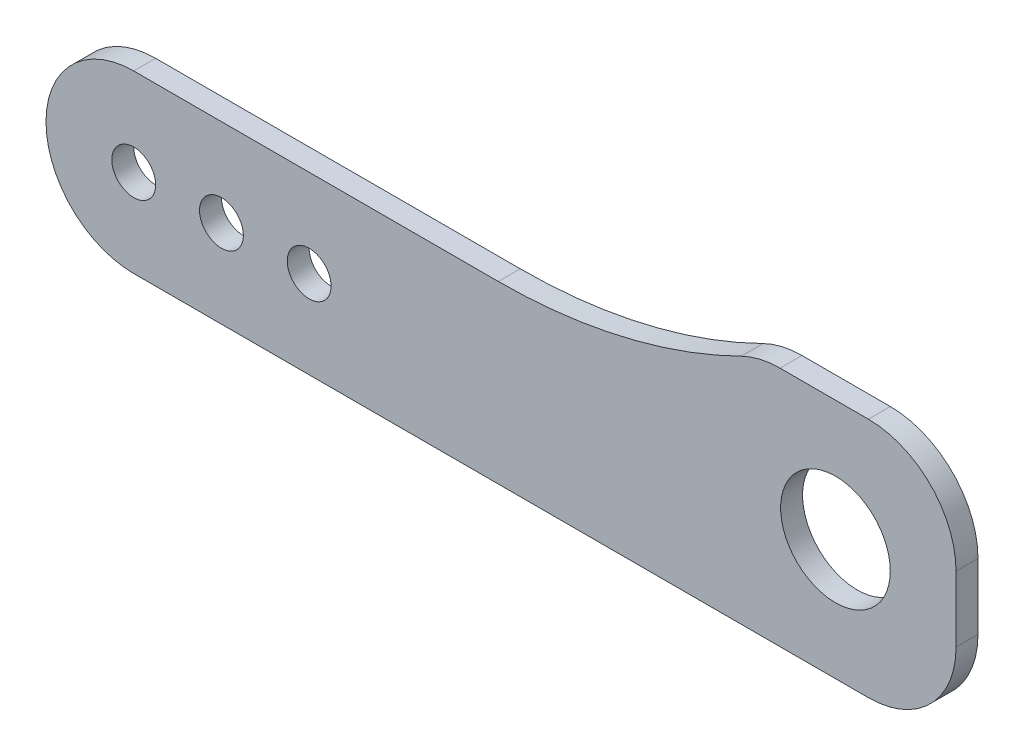
ISO-10303-21;
HEADER;
FILE_DESCRIPTION(('STEP AP214'),'2;1');
FILE_NAME('part.step','',(''),(''),'','','');
FILE_SCHEMA(('AUTOMOTIVE_DESIGN { 1 0 10303 214 1 1 1 1 }'));
ENDSEC;
DATA;
#1=APPLICATION_CONTEXT('core data for automotive mechanical design processes');
#2=APPLICATION_PROTOCOL_DEFINITION('international standard','automotive_design',2000,#1);
#3=PRODUCT_CONTEXT('',#1,'mechanical');
#4=PRODUCT('Part','Part','',(#3));
#5=PRODUCT_RELATED_PRODUCT_CATEGORY('part','',(#4));
#6=PRODUCT_DEFINITION_FORMATION('','',#4);
#7=PRODUCT_DEFINITION_CONTEXT('part definition',#1,'design');
#8=PRODUCT_DEFINITION('design','',#6,#7);
#9=PRODUCT_DEFINITION_SHAPE('','',#8);
#10=(LENGTH_UNIT() NAMED_UNIT(*) SI_UNIT(.MILLI.,.METRE.));
#11=(NAMED_UNIT(*) PLANE_ANGLE_UNIT() SI_UNIT($,.RADIAN.));
#12=(NAMED_UNIT(*) SI_UNIT($,.STERADIAN.) SOLID_ANGLE_UNIT());
#13=UNCERTAINTY_MEASURE_WITH_UNIT(LENGTH_MEASURE(1.E-05),#10,'distance_accuracy_value','');
#14=(GEOMETRIC_REPRESENTATION_CONTEXT(3) GLOBAL_UNCERTAINTY_ASSIGNED_CONTEXT((#13)) GLOBAL_UNIT_ASSIGNED_CONTEXT((#10,
#11,#12)) REPRESENTATION_CONTEXT('',''));
#15=CARTESIAN_POINT('',(0.,0.,0.));
#16=DIRECTION('',(0.,0.,1.));
#17=DIRECTION('',(1.,0.,0.));
#18=AXIS2_PLACEMENT_3D('',#15,#16,#17);
#19=CARTESIAN_POINT('',(67.,0.,2.));
#20=DIRECTION('',(0.,0.,-1.));
#21=DIRECTION('',(-1.,0.,0.));
#22=AXIS2_PLACEMENT_3D('',#19,#20,#21);
#23=CYLINDRICAL_SURFACE('',#22,8.);
#24=CARTESIAN_POINT('',(67.,0.,0.));
#25=DIRECTION('',(0.,0.,1.));
#26=DIRECTION('',(1.,0.,0.));
#27=AXIS2_PLACEMENT_3D('',#24,#25,#26);
#28=CIRCLE('',#27,8.);
#29=CARTESIAN_POINT('',(67.,-7.99999999999999,0.));
#30=VERTEX_POINT('',#29);
#31=CARTESIAN_POINT('',(75.,0.,0.));
#32=VERTEX_POINT('',#31);
#33=EDGE_CURVE('E146',#30,#32,#28,.T.);
#34=ORIENTED_EDGE('',*,*,#33,.T.);
#35=DIRECTION('',(0.,0.,-1.));
#36=VECTOR('',#35,1.);
#37=CARTESIAN_POINT('',(75.,0.,2.));
#38=LINE('',#37,#36);
#39=CARTESIAN_POINT('',(75.,0.,2.));
#40=VERTEX_POINT('',#39);
#41=EDGE_CURVE('E11',#40,#32,#38,.T.);
#42=ORIENTED_EDGE('',*,*,#41,.F.);
#43=CARTESIAN_POINT('',(67.,0.,2.));
#44=DIRECTION('',(0.,0.,1.));
#45=DIRECTION('',(1.,0.,0.));
#46=AXIS2_PLACEMENT_3D('',#43,#44,#45);
#47=CIRCLE('',#46,8.);
#48=CARTESIAN_POINT('',(67.,-7.99999999999999,2.));
#49=VERTEX_POINT('',#48);
#50=EDGE_CURVE('E172',#49,#40,#47,.T.);
#51=ORIENTED_EDGE('',*,*,#50,.F.);
#52=DIRECTION('',(0.,0.,-1.));
#53=VECTOR('',#52,1.);
#54=CARTESIAN_POINT('',(67.,-7.99999999999999,2.));
#55=LINE('',#54,#53);
#56=EDGE_CURVE('E142',#49,#30,#55,.T.);
#57=ORIENTED_EDGE('',*,*,#56,.T.);
#58=EDGE_LOOP('',(#34,#42,#51,#57));
#59=FACE_BOUND('',#58,.T.);
#60=ADVANCED_FACE('F39',(#59),#23,.T.);
#61=CARTESIAN_POINT('',(75.,0.,2.));
#62=DIRECTION('',(-1.,0.,0.));
#63=DIRECTION('',(0.,-1.,0.));
#64=AXIS2_PLACEMENT_3D('',#61,#62,#63);
#65=PLANE('',#64);
#66=DIRECTION('',(0.,1.,0.));
#67=VECTOR('',#66,1.);
#68=CARTESIAN_POINT('',(75.,0.,0.));
#69=LINE('',#68,#67);
#70=CARTESIAN_POINT('',(75.,6.00000000000001,0.));
#71=VERTEX_POINT('',#70);
#72=EDGE_CURVE('E150',#32,#71,#69,.T.);
#73=ORIENTED_EDGE('',*,*,#72,.T.);
#74=DIRECTION('',(0.,0.,-1.));
#75=VECTOR('',#74,1.);
#76=CARTESIAN_POINT('',(75.,6.00000000000001,2.));
#77=LINE('',#76,#75);
#78=CARTESIAN_POINT('',(75.,6.00000000000001,2.));
#79=VERTEX_POINT('',#78);
#80=EDGE_CURVE('E48',#79,#71,#77,.T.);
#81=ORIENTED_EDGE('',*,*,#80,.F.);
#82=DIRECTION('',(0.,1.,0.));
#83=VECTOR('',#82,1.);
#84=CARTESIAN_POINT('',(75.,0.,2.));
#85=LINE('',#84,#83);
#86=EDGE_CURVE('E102',#40,#79,#85,.T.);
#87=ORIENTED_EDGE('',*,*,#86,.F.);
#88=ORIENTED_EDGE('',*,*,#41,.T.);
#89=EDGE_LOOP('',(#73,#81,#87,#88));
#90=FACE_BOUND('',#89,.T.);
#91=ADVANCED_FACE('F285',(#90),#65,.F.);
#92=CARTESIAN_POINT('',(67.,6.00000000000001,2.));
#93=DIRECTION('',(0.,0.,-1.));
#94=DIRECTION('',(-1.,0.,0.));
#95=AXIS2_PLACEMENT_3D('',#92,#93,#94);
#96=CYLINDRICAL_SURFACE('',#95,8.);
#97=CARTESIAN_POINT('',(67.,6.00000000000001,0.));
#98=DIRECTION('',(0.,0.,1.));
#99=DIRECTION('',(-1.,0.,0.));
#100=AXIS2_PLACEMENT_3D('',#97,#98,#99);
#101=CIRCLE('',#100,8.);
#102=CARTESIAN_POINT('',(67.,14.,0.));
#103=VERTEX_POINT('',#102);
#104=EDGE_CURVE('E154',#71,#103,#101,.T.);
#105=ORIENTED_EDGE('',*,*,#104,.T.);
#106=DIRECTION('',(0.,0.,-1.));
#107=VECTOR('',#106,1.);
#108=CARTESIAN_POINT('',(67.,14.,2.));
#109=LINE('',#108,#107);
#110=CARTESIAN_POINT('',(67.,14.,2.));
#111=VERTEX_POINT('',#110);
#112=EDGE_CURVE('E187',#111,#103,#109,.T.);
#113=ORIENTED_EDGE('',*,*,#112,.F.);
#114=CARTESIAN_POINT('',(67.,6.00000000000001,2.));
#115=DIRECTION('',(0.,0.,1.));
#116=DIRECTION('',(-1.,0.,0.));
#117=AXIS2_PLACEMENT_3D('',#114,#115,#116);
#118=CIRCLE('',#117,8.);
#119=EDGE_CURVE('E197',#79,#111,#118,.T.);
#120=ORIENTED_EDGE('',*,*,#119,.F.);
#121=ORIENTED_EDGE('',*,*,#80,.T.);
#122=EDGE_LOOP('',(#105,#113,#120,#121));
#123=FACE_BOUND('',#122,.T.);
#124=ADVANCED_FACE('F195',(#123),#96,.T.);
#125=CARTESIAN_POINT('',(58.9417809832544,14.,2.));
#126=DIRECTION('',(0.,-1.,0.));
#127=DIRECTION('',(1.,0.,0.));
#128=AXIS2_PLACEMENT_3D('',#125,#126,#127);
#129=PLANE('',#128);
#130=DIRECTION('',(-1.,0.,0.));
#131=VECTOR('',#130,1.);
#132=CARTESIAN_POINT('',(58.9417809832544,14.,0.));
#133=LINE('',#132,#131);
#134=CARTESIAN_POINT('',(58.9417809832544,14.,0.));
#135=VERTEX_POINT('',#134);
#136=EDGE_CURVE('E157',#103,#135,#133,.T.);
#137=ORIENTED_EDGE('',*,*,#136,.T.);
#138=DIRECTION('',(0.,0.,-1.));
#139=VECTOR('',#138,1.);
#140=CARTESIAN_POINT('',(58.9417809832544,14.,2.));
#141=LINE('',#140,#139);
#142=CARTESIAN_POINT('',(58.9417809832544,14.,2.));
#143=VERTEX_POINT('',#142);
#144=EDGE_CURVE('E183',#143,#135,#141,.T.);
#145=ORIENTED_EDGE('',*,*,#144,.F.);
#146=DIRECTION('',(-1.,0.,0.));
#147=VECTOR('',#146,1.);
#148=CARTESIAN_POINT('',(58.9417809832544,14.,2.));
#149=LINE('',#148,#147);
#150=EDGE_CURVE('E214',#111,#143,#149,.T.);
#151=ORIENTED_EDGE('',*,*,#150,.F.);
#152=ORIENTED_EDGE('',*,*,#112,.T.);
#153=EDGE_LOOP('',(#137,#145,#151,#152));
#154=FACE_BOUND('',#153,.T.);
#155=ADVANCED_FACE('F206',(#154),#129,.F.);
#156=CARTESIAN_POINT('',(58.9417809832544,6.00000000000001,2.));
#157=DIRECTION('',(0.,0.,-1.));
#158=DIRECTION('',(-1.,0.,0.));
#159=AXIS2_PLACEMENT_3D('',#156,#157,#158);
#160=CYLINDRICAL_SURFACE('',#159,7.99999999999999);
#161=CARTESIAN_POINT('',(58.9417809832544,6.00000000000001,0.));
#162=DIRECTION('',(0.,0.,1.));
#163=DIRECTION('',(1.,0.,0.));
#164=AXIS2_PLACEMENT_3D('',#161,#162,#163);
#165=CIRCLE('',#164,7.99999999999999);
#166=CARTESIAN_POINT('',(55.3982685477606,13.1724137931035,0.));
#167=VERTEX_POINT('',#166);
#168=EDGE_CURVE('E160',#135,#167,#165,.T.);
#169=ORIENTED_EDGE('',*,*,#168,.T.);
#170=DIRECTION('',(0.,0.,-1.));
#171=VECTOR('',#170,1.);
#172=CARTESIAN_POINT('',(55.3982685477606,13.1724137931035,2.));
#173=LINE('',#172,#171);
#174=CARTESIAN_POINT('',(55.3982685477606,13.1724137931035,2.));
#175=VERTEX_POINT('',#174);
#176=EDGE_CURVE('E179',#175,#167,#173,.T.);
#177=ORIENTED_EDGE('',*,*,#176,.F.);
#178=CARTESIAN_POINT('',(58.9417809832544,6.00000000000001,2.));
#179=DIRECTION('',(0.,0.,1.));
#180=DIRECTION('',(1.,0.,0.));
#181=AXIS2_PLACEMENT_3D('',#178,#179,#180);
#182=CIRCLE('',#181,7.99999999999999);
#183=EDGE_CURVE('E212',#143,#175,#182,.T.);
#184=ORIENTED_EDGE('',*,*,#183,.F.);
#185=ORIENTED_EDGE('',*,*,#144,.T.);
#186=EDGE_LOOP('',(#169,#177,#184,#185));
#187=FACE_BOUND('',#186,.T.);
#188=ADVANCED_FACE('F210',(#187),#160,.T.);
#189=CARTESIAN_POINT('',(33.2513158259242,58.,2.));
#190=DIRECTION('',(0.,0.,-1.));
#191=DIRECTION('',(-1.,0.,0.));
#192=AXIS2_PLACEMENT_3D('',#189,#190,#191);
#193=CYLINDRICAL_SURFACE('',#192,50.);
#194=CARTESIAN_POINT('',(33.2513158259242,58.,0.));
#195=DIRECTION('',(0.,0.,-1.));
#196=DIRECTION('',(1.,0.,0.));
#197=AXIS2_PLACEMENT_3D('',#194,#195,#196);
#198=CIRCLE('',#197,50.);
#199=CARTESIAN_POINT('',(33.2513158259242,8.,0.));
#200=VERTEX_POINT('',#199);
#201=EDGE_CURVE('E163',#167,#200,#198,.T.);
#202=ORIENTED_EDGE('',*,*,#201,.T.);
#203=DIRECTION('',(0.,0.,-1.));
#204=VECTOR('',#203,1.);
#205=CARTESIAN_POINT('',(33.2513158259242,8.,2.));
#206=LINE('',#205,#204);
#207=CARTESIAN_POINT('',(33.2513158259242,8.,2.));
#208=VERTEX_POINT('',#207);
#209=EDGE_CURVE('E135',#208,#200,#206,.T.);
#210=ORIENTED_EDGE('',*,*,#209,.F.);
#211=CARTESIAN_POINT('',(33.2513158259242,58.,2.));
#212=DIRECTION('',(0.,0.,-1.));
#213=DIRECTION('',(1.,0.,0.));
#214=AXIS2_PLACEMENT_3D('',#211,#212,#213);
#215=CIRCLE('',#214,50.);
#216=EDGE_CURVE('E124',#175,#208,#215,.T.);
#217=ORIENTED_EDGE('',*,*,#216,.F.);
#218=ORIENTED_EDGE('',*,*,#176,.T.);
#219=EDGE_LOOP('',(#202,#210,#217,#218));
#220=FACE_BOUND('',#219,.T.);
#221=ADVANCED_FACE('F293',(#220),#193,.F.);
#222=CARTESIAN_POINT('',(0.,8.,2.));
#223=DIRECTION('',(0.,-1.,0.));
#224=DIRECTION('',(0.,0.,-1.));
#225=AXIS2_PLACEMENT_3D('',#222,#223,#224);
#226=PLANE('',#225);
#227=DIRECTION('',(-1.,0.,0.));
#228=VECTOR('',#227,1.);
#229=CARTESIAN_POINT('',(0.,8.,0.));
#230=LINE('',#229,#228);
#231=CARTESIAN_POINT('',(0.,8.,0.));
#232=VERTEX_POINT('',#231);
#233=EDGE_CURVE('E133',#200,#232,#230,.T.);
#234=ORIENTED_EDGE('',*,*,#233,.T.);
#235=DIRECTION('',(0.,0.,-1.));
#236=VECTOR('',#235,1.);
#237=CARTESIAN_POINT('',(0.,8.,2.));
#238=LINE('',#237,#236);
#239=CARTESIAN_POINT('',(0.,8.,2.));
#240=VERTEX_POINT('',#239);
#241=EDGE_CURVE('E130',#240,#232,#238,.T.);
#242=ORIENTED_EDGE('',*,*,#241,.F.);
#243=DIRECTION('',(-1.,0.,0.));
#244=VECTOR('',#243,1.);
#245=CARTESIAN_POINT('',(0.,8.,2.));
#246=LINE('',#245,#244);
#247=EDGE_CURVE('E118',#208,#240,#246,.T.);
#248=ORIENTED_EDGE('',*,*,#247,.F.);
#249=ORIENTED_EDGE('',*,*,#209,.T.);
#250=EDGE_LOOP('',(#234,#242,#248,#249));
#251=FACE_BOUND('',#250,.T.);
#252=ADVANCED_FACE('F131',(#251),#226,.F.);
#253=CARTESIAN_POINT('',(0.,0.,2.));
#254=DIRECTION('',(0.,0.,-1.));
#255=DIRECTION('',(-1.,0.,0.));
#256=AXIS2_PLACEMENT_3D('',#253,#254,#255);
#257=CYLINDRICAL_SURFACE('',#256,8.);
#258=CARTESIAN_POINT('',(0.,0.,0.));
#259=DIRECTION('',(0.,0.,1.));
#260=DIRECTION('',(-1.,0.,0.));
#261=AXIS2_PLACEMENT_3D('',#258,#259,#260);
#262=CIRCLE('',#261,8.);
#263=CARTESIAN_POINT('',(0.,-8.,0.));
#264=VERTEX_POINT('',#263);
#265=EDGE_CURVE('E88',#232,#264,#262,.T.);
#266=ORIENTED_EDGE('',*,*,#265,.T.);
#267=DIRECTION('',(0.,0.,-1.));
#268=VECTOR('',#267,1.);
#269=CARTESIAN_POINT('',(0.,-8.,2.));
#270=LINE('',#269,#268);
#271=CARTESIAN_POINT('',(0.,-8.,2.));
#272=VERTEX_POINT('',#271);
#273=EDGE_CURVE('E136',#272,#264,#270,.T.);
#274=ORIENTED_EDGE('',*,*,#273,.F.);
#275=CARTESIAN_POINT('',(0.,0.,2.));
#276=DIRECTION('',(0.,0.,1.));
#277=DIRECTION('',(-1.,0.,0.));
#278=AXIS2_PLACEMENT_3D('',#275,#276,#277);
#279=CIRCLE('',#278,8.);
#280=EDGE_CURVE('E122',#240,#272,#279,.T.);
#281=ORIENTED_EDGE('',*,*,#280,.F.);
#282=ORIENTED_EDGE('',*,*,#241,.T.);
#283=EDGE_LOOP('',(#266,#274,#281,#282));
#284=FACE_BOUND('',#283,.T.);
#285=ADVANCED_FACE('F138',(#284),#257,.T.);
#286=CARTESIAN_POINT('',(67.,-7.99999999999999,2.));
#287=DIRECTION('',(0.,1.,0.));
#288=DIRECTION('',(-1.,0.,0.));
#289=AXIS2_PLACEMENT_3D('',#286,#287,#288);
#290=PLANE('',#289);
#291=DIRECTION('',(1.,0.,0.));
#292=VECTOR('',#291,1.);
#293=CARTESIAN_POINT('',(67.,-7.99999999999999,0.));
#294=LINE('',#293,#292);
#295=EDGE_CURVE('E94',#264,#30,#294,.T.);
#296=ORIENTED_EDGE('',*,*,#295,.T.);
#297=ORIENTED_EDGE('',*,*,#56,.F.);
#298=DIRECTION('',(1.,0.,0.));
#299=VECTOR('',#298,1.);
#300=CARTESIAN_POINT('',(67.,-7.99999999999999,2.));
#301=LINE('',#300,#299);
#302=EDGE_CURVE('E56',#272,#49,#301,.T.);
#303=ORIENTED_EDGE('',*,*,#302,.F.);
#304=ORIENTED_EDGE('',*,*,#273,.T.);
#305=EDGE_LOOP('',(#296,#297,#303,#304));
#306=FACE_BOUND('',#305,.T.);
#307=ADVANCED_FACE('F262',(#306),#290,.F.);
#308=CARTESIAN_POINT('',(67.,0.,2.));
#309=DIRECTION('',(0.,0.,1.));
#310=DIRECTION('',(1.,0.,0.));
#311=AXIS2_PLACEMENT_3D('',#308,#309,#310);
#312=PLANE('',#311);
#313=CARTESIAN_POINT('',(64.,3.00000000000001,2.));
#314=DIRECTION('',(0.,0.,1.));
#315=DIRECTION('',(1.,0.,0.));
#316=AXIS2_PLACEMENT_3D('',#313,#314,#315);
#317=CIRCLE('',#316,5.);
#318=CARTESIAN_POINT('',(69.,3.00000000000001,2.));
#319=VERTEX_POINT('',#318);
#320=EDGE_CURVE('E253',#319,#319,#317,.T.);
#321=ORIENTED_EDGE('',*,*,#320,.F.);
#322=EDGE_LOOP('',(#321));
#323=FACE_BOUND('',#322,.T.);
#324=CARTESIAN_POINT('',(0.,0.,2.));
#325=DIRECTION('',(0.,0.,1.));
#326=DIRECTION('',(1.,0.,0.));
#327=AXIS2_PLACEMENT_3D('',#324,#325,#326);
#328=CIRCLE('',#327,2.);
#329=CARTESIAN_POINT('',(2.,0.,2.));
#330=VERTEX_POINT('',#329);
#331=EDGE_CURVE('E240',#330,#330,#328,.T.);
#332=ORIENTED_EDGE('',*,*,#331,.F.);
#333=EDGE_LOOP('',(#332));
#334=FACE_BOUND('',#333,.T.);
#335=CARTESIAN_POINT('',(8.,0.,2.));
#336=DIRECTION('',(0.,0.,1.));
#337=DIRECTION('',(1.,0.,0.));
#338=AXIS2_PLACEMENT_3D('',#335,#336,#337);
#339=CIRCLE('',#338,2.);
#340=CARTESIAN_POINT('',(10.,0.,2.));
#341=VERTEX_POINT('',#340);
#342=EDGE_CURVE('E230',#341,#341,#339,.T.);
#343=ORIENTED_EDGE('',*,*,#342,.F.);
#344=EDGE_LOOP('',(#343));
#345=FACE_BOUND('',#344,.T.);
#346=CARTESIAN_POINT('',(16.,0.,2.));
#347=DIRECTION('',(0.,0.,1.));
#348=DIRECTION('',(1.,0.,0.));
#349=AXIS2_PLACEMENT_3D('',#346,#347,#348);
#350=CIRCLE('',#349,2.);
#351=CARTESIAN_POINT('',(18.,0.,2.));
#352=VERTEX_POINT('',#351);
#353=EDGE_CURVE('E231',#352,#352,#350,.T.);
#354=ORIENTED_EDGE('',*,*,#353,.F.);
#355=EDGE_LOOP('',(#354));
#356=FACE_BOUND('',#355,.T.);
#357=ORIENTED_EDGE('',*,*,#50,.T.);
#358=ORIENTED_EDGE('',*,*,#86,.T.);
#359=ORIENTED_EDGE('',*,*,#119,.T.);
#360=ORIENTED_EDGE('',*,*,#150,.T.);
#361=ORIENTED_EDGE('',*,*,#183,.T.);
#362=ORIENTED_EDGE('',*,*,#216,.T.);
#363=ORIENTED_EDGE('',*,*,#247,.T.);
#364=ORIENTED_EDGE('',*,*,#280,.T.);
#365=ORIENTED_EDGE('',*,*,#302,.T.);
#366=EDGE_LOOP('',(#357,#358,#359,#360,#361,#362,#363,#364,#365));
#367=FACE_BOUND('',#366,.T.);
#368=ADVANCED_FACE('F120',(#323,#334,#345,#356,#367),#312,.T.);
#369=CARTESIAN_POINT('',(67.,0.,0.));
#370=DIRECTION('',(0.,0.,1.));
#371=DIRECTION('',(1.,0.,0.));
#372=AXIS2_PLACEMENT_3D('',#369,#370,#371);
#373=PLANE('',#372);
#374=CARTESIAN_POINT('',(64.,3.00000000000001,0.));
#375=DIRECTION('',(0.,0.,1.));
#376=DIRECTION('',(1.,0.,0.));
#377=AXIS2_PLACEMENT_3D('',#374,#375,#376);
#378=CIRCLE('',#377,5.);
#379=CARTESIAN_POINT('',(69.,3.00000000000001,0.));
#380=VERTEX_POINT('',#379);
#381=EDGE_CURVE('E235',#380,#380,#378,.F.);
#382=ORIENTED_EDGE('',*,*,#381,.F.);
#383=EDGE_LOOP('',(#382));
#384=FACE_BOUND('',#383,.T.);
#385=CARTESIAN_POINT('',(0.,0.,0.));
#386=DIRECTION('',(0.,0.,1.));
#387=DIRECTION('',(1.,0.,0.));
#388=AXIS2_PLACEMENT_3D('',#385,#386,#387);
#389=CIRCLE('',#388,2.);
#390=CARTESIAN_POINT('',(2.,0.,0.));
#391=VERTEX_POINT('',#390);
#392=EDGE_CURVE('E151',#391,#391,#389,.F.);
#393=ORIENTED_EDGE('',*,*,#392,.F.);
#394=EDGE_LOOP('',(#393));
#395=FACE_BOUND('',#394,.T.);
#396=CARTESIAN_POINT('',(8.,0.,0.));
#397=DIRECTION('',(0.,0.,1.));
#398=DIRECTION('',(1.,0.,0.));
#399=AXIS2_PLACEMENT_3D('',#396,#397,#398);
#400=CIRCLE('',#399,2.);
#401=CARTESIAN_POINT('',(10.,0.,0.));
#402=VERTEX_POINT('',#401);
#403=EDGE_CURVE('E236',#402,#402,#400,.F.);
#404=ORIENTED_EDGE('',*,*,#403,.F.);
#405=EDGE_LOOP('',(#404));
#406=FACE_BOUND('',#405,.T.);
#407=CARTESIAN_POINT('',(16.,0.,0.));
#408=DIRECTION('',(0.,0.,1.));
#409=DIRECTION('',(1.,0.,0.));
#410=AXIS2_PLACEMENT_3D('',#407,#408,#409);
#411=CIRCLE('',#410,2.);
#412=CARTESIAN_POINT('',(18.,0.,0.));
#413=VERTEX_POINT('',#412);
#414=EDGE_CURVE('E226',#413,#413,#411,.F.);
#415=ORIENTED_EDGE('',*,*,#414,.F.);
#416=EDGE_LOOP('',(#415));
#417=FACE_BOUND('',#416,.T.);
#418=ORIENTED_EDGE('',*,*,#33,.F.);
#419=ORIENTED_EDGE('',*,*,#295,.F.);
#420=ORIENTED_EDGE('',*,*,#265,.F.);
#421=ORIENTED_EDGE('',*,*,#233,.F.);
#422=ORIENTED_EDGE('',*,*,#201,.F.);
#423=ORIENTED_EDGE('',*,*,#168,.F.);
#424=ORIENTED_EDGE('',*,*,#136,.F.);
#425=ORIENTED_EDGE('',*,*,#104,.F.);
#426=ORIENTED_EDGE('',*,*,#72,.F.);
#427=EDGE_LOOP('',(#418,#419,#420,#421,#422,#423,#424,#425,#426));
#428=FACE_BOUND('',#427,.T.);
#429=ADVANCED_FACE('F201',(#384,#395,#406,#417,#428),#373,.F.);
#430=CARTESIAN_POINT('',(16.,0.,-5.65685424949239));
#431=DIRECTION('',(0.,0.,1.));
#432=DIRECTION('',(1.,0.,0.));
#433=AXIS2_PLACEMENT_3D('',#430,#431,#432);
#434=CYLINDRICAL_SURFACE('',#433,2.);
#435=ORIENTED_EDGE('',*,*,#414,.T.);
#436=EDGE_LOOP('',(#435));
#437=FACE_BOUND('',#436,.T.);
#438=ORIENTED_EDGE('',*,*,#353,.T.);
#439=EDGE_LOOP('',(#438));
#440=FACE_BOUND('',#439,.T.);
#441=ADVANCED_FACE('F270',(#437,#440),#434,.F.);
#442=CARTESIAN_POINT('',(8.,0.,-5.65685424949239));
#443=DIRECTION('',(0.,0.,1.));
#444=DIRECTION('',(1.,0.,0.));
#445=AXIS2_PLACEMENT_3D('',#442,#443,#444);
#446=CYLINDRICAL_SURFACE('',#445,2.);
#447=ORIENTED_EDGE('',*,*,#403,.T.);
#448=EDGE_LOOP('',(#447));
#449=FACE_BOUND('',#448,.T.);
#450=ORIENTED_EDGE('',*,*,#342,.T.);
#451=EDGE_LOOP('',(#450));
#452=FACE_BOUND('',#451,.T.);
#453=ADVANCED_FACE('F272',(#449,#452),#446,.F.);
#454=CARTESIAN_POINT('',(0.,0.,-5.65685424949239));
#455=DIRECTION('',(0.,0.,1.));
#456=DIRECTION('',(1.,0.,0.));
#457=AXIS2_PLACEMENT_3D('',#454,#455,#456);
#458=CYLINDRICAL_SURFACE('',#457,2.);
#459=ORIENTED_EDGE('',*,*,#392,.T.);
#460=EDGE_LOOP('',(#459));
#461=FACE_BOUND('',#460,.T.);
#462=ORIENTED_EDGE('',*,*,#331,.T.);
#463=EDGE_LOOP('',(#462));
#464=FACE_BOUND('',#463,.T.);
#465=ADVANCED_FACE('F279',(#461,#464),#458,.F.);
#466=CARTESIAN_POINT('',(64.,3.00000000000001,-14.142135623731));
#467=DIRECTION('',(0.,0.,1.));
#468=DIRECTION('',(1.,0.,0.));
#469=AXIS2_PLACEMENT_3D('',#466,#467,#468);
#470=CYLINDRICAL_SURFACE('',#469,5.);
#471=ORIENTED_EDGE('',*,*,#381,.T.);
#472=EDGE_LOOP('',(#471));
#473=FACE_BOUND('',#472,.T.);
#474=ORIENTED_EDGE('',*,*,#320,.T.);
#475=EDGE_LOOP('',(#474));
#476=FACE_BOUND('',#475,.T.);
#477=ADVANCED_FACE('F258',(#473,#476),#470,.F.);
#478=CLOSED_SHELL('',(#60,#91,#124,#155,#188,#221,#252,#285,#307,#368,#429,#441,#453,#465,#477));
#479=MANIFOLD_SOLID_BREP('B2',#478);
#480=ADVANCED_BREP_SHAPE_REPRESENTATION('',(#18,#479),#14);
#481=SHAPE_DEFINITION_REPRESENTATION(#9,#480);
ENDSEC;
END-ISO-10303-21;
